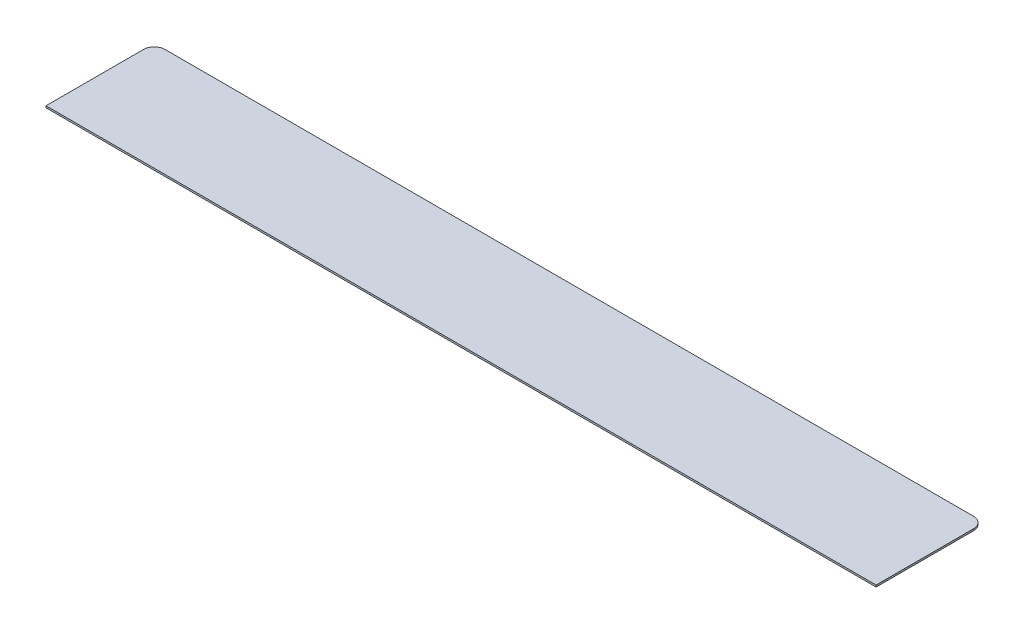
ISO-10303-21;
HEADER;
FILE_DESCRIPTION(('STEP AP214'),'2;1');
FILE_NAME('part.step','',(''),(''),'','','');
FILE_SCHEMA(('AUTOMOTIVE_DESIGN { 1 0 10303 214 1 1 1 1 }'));
ENDSEC;
DATA;
#1=APPLICATION_CONTEXT('core data for automotive mechanical design processes');
#2=APPLICATION_PROTOCOL_DEFINITION('international standard','automotive_design',2000,#1);
#3=PRODUCT_CONTEXT('',#1,'mechanical');
#4=PRODUCT('Part','Part','',(#3));
#5=PRODUCT_RELATED_PRODUCT_CATEGORY('part','',(#4));
#6=PRODUCT_DEFINITION_FORMATION('','',#4);
#7=PRODUCT_DEFINITION_CONTEXT('part definition',#1,'design');
#8=PRODUCT_DEFINITION('design','',#6,#7);
#9=PRODUCT_DEFINITION_SHAPE('','',#8);
#10=(LENGTH_UNIT() NAMED_UNIT(*) SI_UNIT(.MILLI.,.METRE.));
#11=(NAMED_UNIT(*) PLANE_ANGLE_UNIT() SI_UNIT($,.RADIAN.));
#12=(NAMED_UNIT(*) SI_UNIT($,.STERADIAN.) SOLID_ANGLE_UNIT());
#13=UNCERTAINTY_MEASURE_WITH_UNIT(LENGTH_MEASURE(1.E-05),#10,'distance_accuracy_value','');
#14=(GEOMETRIC_REPRESENTATION_CONTEXT(3) GLOBAL_UNCERTAINTY_ASSIGNED_CONTEXT((#13)) GLOBAL_UNIT_ASSIGNED_CONTEXT((#10,
#11,#12)) REPRESENTATION_CONTEXT('',''));
#15=CARTESIAN_POINT('',(0.,0.,0.));
#16=DIRECTION('',(0.,0.,1.));
#17=DIRECTION('',(1.,0.,0.));
#18=AXIS2_PLACEMENT_3D('',#15,#16,#17);
#19=CARTESIAN_POINT('',(115.,0.5,-15.));
#20=DIRECTION('',(-1.,0.,0.));
#21=DIRECTION('',(0.,0.,1.));
#22=AXIS2_PLACEMENT_3D('',#19,#20,#21);
#23=PLANE('',#22);
#24=DIRECTION('',(0.,0.,-1.));
#25=VECTOR('',#24,1.);
#26=CARTESIAN_POINT('',(115.,0.,-15.));
#27=LINE('',#26,#25);
#28=CARTESIAN_POINT('',(115.,0.,15.));
#29=VERTEX_POINT('',#28);
#30=CARTESIAN_POINT('',(115.,0.,-12.));
#31=VERTEX_POINT('',#30);
#32=EDGE_CURVE('E112',#29,#31,#27,.T.);
#33=ORIENTED_EDGE('',*,*,#32,.T.);
#34=DIRECTION('',(0.,-1.,0.));
#35=VECTOR('',#34,1.);
#36=CARTESIAN_POINT('',(115.,0.5,-12.));
#37=LINE('',#36,#35);
#38=CARTESIAN_POINT('',(115.,0.5,-12.));
#39=VERTEX_POINT('',#38);
#40=EDGE_CURVE('E56',#31,#39,#37,.F.);
#41=ORIENTED_EDGE('',*,*,#40,.T.);
#42=DIRECTION('',(0.,0.,-1.));
#43=VECTOR('',#42,1.);
#44=CARTESIAN_POINT('',(115.,0.5,-15.));
#45=LINE('',#44,#43);
#46=CARTESIAN_POINT('',(115.,0.5,15.));
#47=VERTEX_POINT('',#46);
#48=EDGE_CURVE('E119',#47,#39,#45,.T.);
#49=ORIENTED_EDGE('',*,*,#48,.F.);
#50=DIRECTION('',(0.,-1.,0.));
#51=VECTOR('',#50,1.);
#52=CARTESIAN_POINT('',(115.,0.5,15.));
#53=LINE('',#52,#51);
#54=EDGE_CURVE('E104',#47,#29,#53,.T.);
#55=ORIENTED_EDGE('',*,*,#54,.T.);
#56=EDGE_LOOP('',(#33,#41,#49,#55));
#57=FACE_BOUND('',#56,.T.);
#58=ADVANCED_FACE('F33',(#57),#23,.F.);
#59=CARTESIAN_POINT('',(-115.,0.5,-15.));
#60=DIRECTION('',(0.,0.,1.));
#61=DIRECTION('',(1.,0.,0.));
#62=AXIS2_PLACEMENT_3D('',#59,#60,#61);
#63=PLANE('',#62);
#64=DIRECTION('',(-1.,0.,0.));
#65=VECTOR('',#64,1.);
#66=CARTESIAN_POINT('',(-115.,0.5,-15.));
#67=LINE('',#66,#65);
#68=CARTESIAN_POINT('',(112.,0.5,-15.));
#69=VERTEX_POINT('',#68);
#70=CARTESIAN_POINT('',(-112.,0.5,-15.));
#71=VERTEX_POINT('',#70);
#72=EDGE_CURVE('E94',#69,#71,#67,.T.);
#73=ORIENTED_EDGE('',*,*,#72,.F.);
#74=DIRECTION('',(0.,-1.,0.));
#75=VECTOR('',#74,1.);
#76=CARTESIAN_POINT('',(112.,0.5,-15.));
#77=LINE('',#76,#75);
#78=CARTESIAN_POINT('',(112.,0.,-15.));
#79=VERTEX_POINT('',#78);
#80=EDGE_CURVE('E122',#69,#79,#77,.T.);
#81=ORIENTED_EDGE('',*,*,#80,.T.);
#82=DIRECTION('',(-1.,0.,0.));
#83=VECTOR('',#82,1.);
#84=CARTESIAN_POINT('',(-115.,0.,-15.));
#85=LINE('',#84,#83);
#86=CARTESIAN_POINT('',(-112.,0.,-15.));
#87=VERTEX_POINT('',#86);
#88=EDGE_CURVE('E114',#79,#87,#85,.T.);
#89=ORIENTED_EDGE('',*,*,#88,.T.);
#90=DIRECTION('',(0.,-1.,0.));
#91=VECTOR('',#90,1.);
#92=CARTESIAN_POINT('',(-112.,0.5,-15.));
#93=LINE('',#92,#91);
#94=EDGE_CURVE('E103',#87,#71,#93,.F.);
#95=ORIENTED_EDGE('',*,*,#94,.T.);
#96=EDGE_LOOP('',(#73,#81,#89,#95));
#97=FACE_BOUND('',#96,.T.);
#98=ADVANCED_FACE('F135',(#97),#63,.F.);
#99=CARTESIAN_POINT('',(-115.,0.5,-15.));
#100=DIRECTION('',(1.,0.,0.));
#101=DIRECTION('',(0.,0.,-1.));
#102=AXIS2_PLACEMENT_3D('',#99,#100,#101);
#103=PLANE('',#102);
#104=DIRECTION('',(0.,0.,1.));
#105=VECTOR('',#104,1.);
#106=CARTESIAN_POINT('',(-115.,0.5,-15.));
#107=LINE('',#106,#105);
#108=CARTESIAN_POINT('',(-115.,0.5,-12.));
#109=VERTEX_POINT('',#108);
#110=CARTESIAN_POINT('',(-115.,0.5,15.));
#111=VERTEX_POINT('',#110);
#112=EDGE_CURVE('E86',#109,#111,#107,.T.);
#113=ORIENTED_EDGE('',*,*,#112,.F.);
#114=DIRECTION('',(0.,-1.,0.));
#115=VECTOR('',#114,1.);
#116=CARTESIAN_POINT('',(-115.,0.5,-12.));
#117=LINE('',#116,#115);
#118=CARTESIAN_POINT('',(-115.,0.,-12.));
#119=VERTEX_POINT('',#118);
#120=EDGE_CURVE('E11',#109,#119,#117,.T.);
#121=ORIENTED_EDGE('',*,*,#120,.T.);
#122=DIRECTION('',(0.,0.,1.));
#123=VECTOR('',#122,1.);
#124=CARTESIAN_POINT('',(-115.,0.,-15.));
#125=LINE('',#124,#123);
#126=CARTESIAN_POINT('',(-115.,0.,15.));
#127=VERTEX_POINT('',#126);
#128=EDGE_CURVE('E100',#119,#127,#125,.T.);
#129=ORIENTED_EDGE('',*,*,#128,.T.);
#130=DIRECTION('',(0.,-1.,0.));
#131=VECTOR('',#130,1.);
#132=CARTESIAN_POINT('',(-115.,0.5,15.));
#133=LINE('',#132,#131);
#134=EDGE_CURVE('E97',#111,#127,#133,.T.);
#135=ORIENTED_EDGE('',*,*,#134,.F.);
#136=EDGE_LOOP('',(#113,#121,#129,#135));
#137=FACE_BOUND('',#136,.T.);
#138=ADVANCED_FACE('F98',(#137),#103,.F.);
#139=CARTESIAN_POINT('',(-115.,0.5,15.));
#140=DIRECTION('',(0.,0.,-1.));
#141=DIRECTION('',(-1.,0.,0.));
#142=AXIS2_PLACEMENT_3D('',#139,#140,#141);
#143=PLANE('',#142);
#144=DIRECTION('',(1.,0.,0.));
#145=VECTOR('',#144,1.);
#146=CARTESIAN_POINT('',(-115.,0.,15.));
#147=LINE('',#146,#145);
#148=EDGE_CURVE('E118',#127,#29,#147,.T.);
#149=ORIENTED_EDGE('',*,*,#148,.T.);
#150=ORIENTED_EDGE('',*,*,#54,.F.);
#151=DIRECTION('',(1.,0.,0.));
#152=VECTOR('',#151,1.);
#153=CARTESIAN_POINT('',(-115.,0.5,15.));
#154=LINE('',#153,#152);
#155=EDGE_CURVE('E90',#111,#47,#154,.T.);
#156=ORIENTED_EDGE('',*,*,#155,.F.);
#157=ORIENTED_EDGE('',*,*,#134,.T.);
#158=EDGE_LOOP('',(#149,#150,#156,#157));
#159=FACE_BOUND('',#158,.T.);
#160=ADVANCED_FACE('F106',(#159),#143,.F.);
#161=CARTESIAN_POINT('',(0.,0.5,0.));
#162=DIRECTION('',(0.,1.,0.));
#163=DIRECTION('',(0.,0.,1.));
#164=AXIS2_PLACEMENT_3D('',#161,#162,#163);
#165=PLANE('',#164);
#166=ORIENTED_EDGE('',*,*,#48,.T.);
#167=CARTESIAN_POINT('',(112.,0.5,-12.));
#168=DIRECTION('',(0.,1.,0.));
#169=DIRECTION('',(0.,0.,1.));
#170=AXIS2_PLACEMENT_3D('',#167,#168,#169);
#171=CIRCLE('',#170,3.);
#172=EDGE_CURVE('E41',#39,#69,#171,.T.);
#173=ORIENTED_EDGE('',*,*,#172,.T.);
#174=ORIENTED_EDGE('',*,*,#72,.T.);
#175=CARTESIAN_POINT('',(-112.,0.5,-12.));
#176=DIRECTION('',(0.,1.,0.));
#177=DIRECTION('',(0.,0.,1.));
#178=AXIS2_PLACEMENT_3D('',#175,#176,#177);
#179=CIRCLE('',#178,3.);
#180=EDGE_CURVE('E48',#71,#109,#179,.T.);
#181=ORIENTED_EDGE('',*,*,#180,.T.);
#182=ORIENTED_EDGE('',*,*,#112,.T.);
#183=ORIENTED_EDGE('',*,*,#155,.T.);
#184=EDGE_LOOP('',(#166,#173,#174,#181,#182,#183));
#185=FACE_BOUND('',#184,.T.);
#186=ADVANCED_FACE('F88',(#185),#165,.T.);
#187=CARTESIAN_POINT('',(0.,0.,0.));
#188=DIRECTION('',(0.,1.,0.));
#189=DIRECTION('',(0.,0.,1.));
#190=AXIS2_PLACEMENT_3D('',#187,#188,#189);
#191=PLANE('',#190);
#192=ORIENTED_EDGE('',*,*,#88,.F.);
#193=CARTESIAN_POINT('',(112.,0.,-12.));
#194=DIRECTION('',(0.,1.,0.));
#195=DIRECTION('',(0.,0.,1.));
#196=AXIS2_PLACEMENT_3D('',#193,#194,#195);
#197=CIRCLE('',#196,3.);
#198=EDGE_CURVE('E127',#79,#31,#197,.F.);
#199=ORIENTED_EDGE('',*,*,#198,.T.);
#200=ORIENTED_EDGE('',*,*,#32,.F.);
#201=ORIENTED_EDGE('',*,*,#148,.F.);
#202=ORIENTED_EDGE('',*,*,#128,.F.);
#203=CARTESIAN_POINT('',(-112.,0.,-12.));
#204=DIRECTION('',(0.,1.,0.));
#205=DIRECTION('',(0.,0.,1.));
#206=AXIS2_PLACEMENT_3D('',#203,#204,#205);
#207=CIRCLE('',#206,3.);
#208=EDGE_CURVE('E125',#119,#87,#207,.F.);
#209=ORIENTED_EDGE('',*,*,#208,.T.);
#210=EDGE_LOOP('',(#192,#199,#200,#201,#202,#209));
#211=FACE_BOUND('',#210,.T.);
#212=ADVANCED_FACE('F141',(#211),#191,.F.);
#213=CARTESIAN_POINT('',(112.,0.5,-12.));
#214=DIRECTION('',(0.,-1.,0.));
#215=DIRECTION('',(0.,0.,-1.));
#216=AXIS2_PLACEMENT_3D('',#213,#214,#215);
#217=CYLINDRICAL_SURFACE('',#216,3.);
#218=ORIENTED_EDGE('',*,*,#172,.F.);
#219=ORIENTED_EDGE('',*,*,#40,.F.);
#220=ORIENTED_EDGE('',*,*,#198,.F.);
#221=ORIENTED_EDGE('',*,*,#80,.F.);
#222=EDGE_LOOP('',(#218,#219,#220,#221));
#223=FACE_BOUND('',#222,.T.);
#224=ADVANCED_FACE('F138',(#223),#217,.T.);
#225=CARTESIAN_POINT('',(-112.,0.5,-12.));
#226=DIRECTION('',(0.,-1.,0.));
#227=DIRECTION('',(0.,0.,-1.));
#228=AXIS2_PLACEMENT_3D('',#225,#226,#227);
#229=CYLINDRICAL_SURFACE('',#228,3.);
#230=ORIENTED_EDGE('',*,*,#180,.F.);
#231=ORIENTED_EDGE('',*,*,#94,.F.);
#232=ORIENTED_EDGE('',*,*,#208,.F.);
#233=ORIENTED_EDGE('',*,*,#120,.F.);
#234=EDGE_LOOP('',(#230,#231,#232,#233));
#235=FACE_BOUND('',#234,.T.);
#236=ADVANCED_FACE('F35',(#235),#229,.T.);
#237=CLOSED_SHELL('',(#58,#98,#138,#160,#186,#212,#224,#236));
#238=MANIFOLD_SOLID_BREP('B2',#237);
#239=ADVANCED_BREP_SHAPE_REPRESENTATION('',(#18,#238),#14);
#240=SHAPE_DEFINITION_REPRESENTATION(#9,#239);
ENDSEC;
END-ISO-10303-21;
